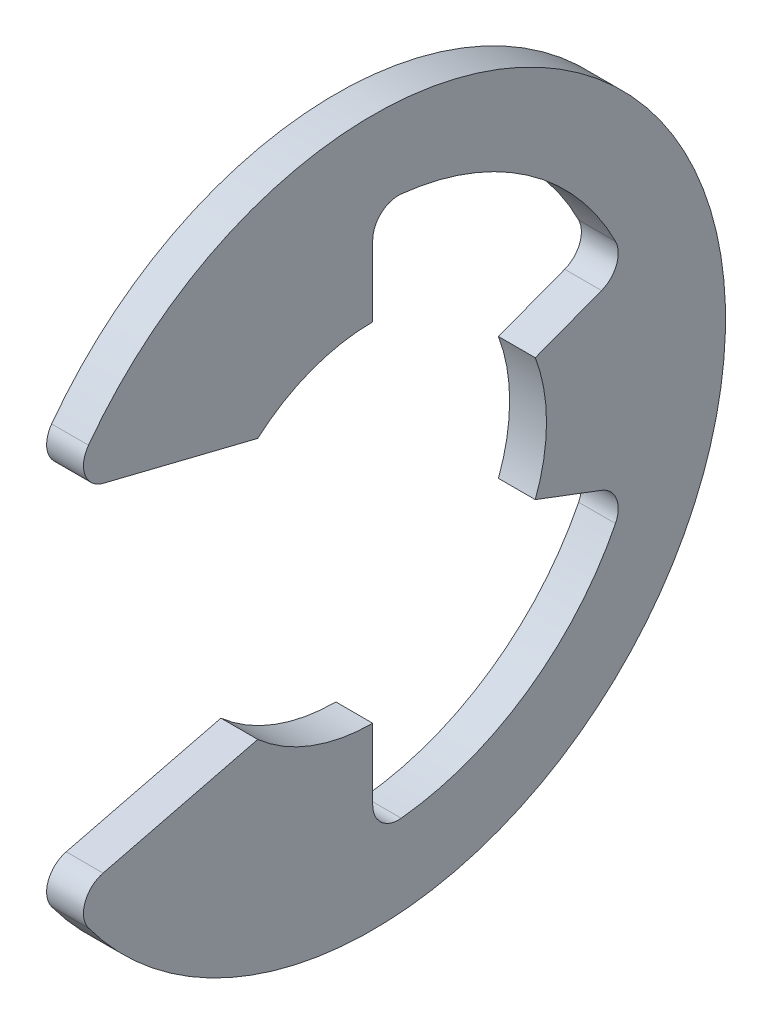
ISO-10303-21;
HEADER;
FILE_DESCRIPTION(('STEP AP214'),'2;1');
FILE_NAME('part.step','',(''),(''),'','','');
FILE_SCHEMA(('AUTOMOTIVE_DESIGN { 1 0 10303 214 1 1 1 1 }'));
ENDSEC;
DATA;
#1=APPLICATION_CONTEXT('core data for automotive mechanical design processes');
#2=APPLICATION_PROTOCOL_DEFINITION('international standard','automotive_design',2000,#1);
#3=PRODUCT_CONTEXT('',#1,'mechanical');
#4=PRODUCT('Part','Part','',(#3));
#5=PRODUCT_RELATED_PRODUCT_CATEGORY('part','',(#4));
#6=PRODUCT_DEFINITION_FORMATION('','',#4);
#7=PRODUCT_DEFINITION_CONTEXT('part definition',#1,'design');
#8=PRODUCT_DEFINITION('design','',#6,#7);
#9=PRODUCT_DEFINITION_SHAPE('','',#8);
#10=(LENGTH_UNIT() NAMED_UNIT(*) SI_UNIT(.MILLI.,.METRE.));
#11=(NAMED_UNIT(*) PLANE_ANGLE_UNIT() SI_UNIT($,.RADIAN.));
#12=(NAMED_UNIT(*) SI_UNIT($,.STERADIAN.) SOLID_ANGLE_UNIT());
#13=UNCERTAINTY_MEASURE_WITH_UNIT(LENGTH_MEASURE(1.E-05),#10,'distance_accuracy_value','');
#14=(GEOMETRIC_REPRESENTATION_CONTEXT(3) GLOBAL_UNCERTAINTY_ASSIGNED_CONTEXT((#13)) GLOBAL_UNIT_ASSIGNED_CONTEXT((#10,
#11,#12)) REPRESENTATION_CONTEXT('',''));
#15=CARTESIAN_POINT('',(0.,0.,0.));
#16=DIRECTION('',(0.,0.,1.));
#17=DIRECTION('',(1.,0.,0.));
#18=AXIS2_PLACEMENT_3D('',#15,#16,#17);
#19=CARTESIAN_POINT('',(-0.5334,0.,0.));
#20=DIRECTION('',(1.,0.,0.));
#21=DIRECTION('',(0.,0.,-1.));
#22=AXIS2_PLACEMENT_3D('',#19,#20,#21);
#23=PLANE('',#22);
#24=CARTESIAN_POINT('',(-0.5334,-5.60812276543936,7.62345146041875));
#25=DIRECTION('',(-1.,0.,0.));
#26=DIRECTION('',(0.,0.,1.));
#27=AXIS2_PLACEMENT_3D('',#24,#25,#26);
#28=CIRCLE('',#27,0.746760000000001);
#29=CARTESIAN_POINT('',(-0.5334,-4.88336468232429,7.80338538873514));
#30=VERTEX_POINT('',#29);
#31=CARTESIAN_POINT('',(-0.5334,-6.05063164709239,8.22497983652265));
#32=VERTEX_POINT('',#31);
#33=EDGE_CURVE('E19',#30,#32,#28,.F.);
#34=ORIENTED_EDGE('',*,*,#33,.F.);
#35=DIRECTION('',(0.,0.240952820606873,-0.970536829925373));
#36=VECTOR('',#35,1.);
#37=CARTESIAN_POINT('',(-0.5334,-5.13688856516319,8.82455735485331));
#38=LINE('',#37,#36);
#39=CARTESIAN_POINT('',(-0.5334,-3.7719,3.32650312340151));
#40=VERTEX_POINT('',#39);
#41=EDGE_CURVE('E143',#30,#40,#38,.T.);
#42=ORIENTED_EDGE('',*,*,#41,.T.);
#43=CARTESIAN_POINT('',(-0.5334,0.,0.));
#44=DIRECTION('',(-1.,0.,0.));
#45=DIRECTION('',(0.,0.,1.));
#46=AXIS2_PLACEMENT_3D('',#43,#44,#45);
#47=CIRCLE('',#46,5.0292);
#48=CARTESIAN_POINT('',(-0.5334,-5.0292,0.));
#49=VERTEX_POINT('',#48);
#50=EDGE_CURVE('E221',#40,#49,#47,.F.);
#51=ORIENTED_EDGE('',*,*,#50,.T.);
#52=DIRECTION('',(0.,-1.,0.));
#53=VECTOR('',#52,1.);
#54=CARTESIAN_POINT('',(-0.5334,-5.0292,0.));
#55=LINE('',#54,#53);
#56=CARTESIAN_POINT('',(-0.5334,-7.07977202193844,0.));
#57=VERTEX_POINT('',#56);
#58=EDGE_CURVE('E164',#49,#57,#55,.T.);
#59=ORIENTED_EDGE('',*,*,#58,.T.);
#60=CARTESIAN_POINT('',(-0.5334,-7.07977202193844,-0.74676));
#61=DIRECTION('',(-1.,0.,0.));
#62=DIRECTION('',(0.,0.,1.));
#63=AXIS2_PLACEMENT_3D('',#60,#61,#62);
#64=CIRCLE('',#63,0.74676);
#65=CARTESIAN_POINT('',(-0.5334,-7.82241228858608,-0.825092189765901));
#66=VERTEX_POINT('',#65);
#67=EDGE_CURVE('E223',#57,#66,#64,.F.);
#68=ORIENTED_EDGE('',*,*,#67,.T.);
#69=CARTESIAN_POINT('',(-0.5334,0.,0.));
#70=DIRECTION('',(-1.,0.,0.));
#71=DIRECTION('',(0.,0.,1.));
#72=AXIS2_PLACEMENT_3D('',#69,#70,#71);
#73=CIRCLE('',#72,7.8658064516129);
#74=CARTESIAN_POINT('',(-0.5334,-3.53744345889986,-7.02548253925108));
#75=VERTEX_POINT('',#74);
#76=EDGE_CURVE('E225',#66,#75,#73,.F.);
#77=ORIENTED_EDGE('',*,*,#76,.T.);
#78=CARTESIAN_POINT('',(-0.5334,-3.20160742052056,-6.35850079068093));
#79=DIRECTION('',(-1.,0.,0.));
#80=DIRECTION('',(0.,0.,1.));
#81=AXIS2_PLACEMENT_3D('',#78,#79,#80);
#82=CIRCLE('',#81,0.74676);
#83=CARTESIAN_POINT('',(-0.5334,-2.50307740298373,-6.62252032064036));
#84=VERTEX_POINT('',#83);
#85=EDGE_CURVE('E171',#75,#84,#82,.F.);
#86=ORIENTED_EDGE('',*,*,#85,.T.);
#87=DIRECTION('',(0.,0.353553390593273,0.935414346693486));
#88=VECTOR('',#87,1.);
#89=CARTESIAN_POINT('',(-0.5334,-1.77809071197169,-4.70438583239088));
#90=LINE('',#89,#88);
#91=CARTESIAN_POINT('',(-0.5334,-1.77809071197169,-4.70438583239088));
#92=VERTEX_POINT('',#91);
#93=EDGE_CURVE('E168',#84,#92,#90,.T.);
#94=ORIENTED_EDGE('',*,*,#93,.T.);
#95=CARTESIAN_POINT('',(-0.5334,0.,0.));
#96=DIRECTION('',(-1.,0.,0.));
#97=DIRECTION('',(0.,0.,1.));
#98=AXIS2_PLACEMENT_3D('',#95,#96,#97);
#99=CIRCLE('',#98,5.0292);
#100=CARTESIAN_POINT('',(-0.5334,1.77809071197169,-4.70438583239087));
#101=VERTEX_POINT('',#100);
#102=EDGE_CURVE('E231',#92,#101,#99,.F.);
#103=ORIENTED_EDGE('',*,*,#102,.T.);
#104=DIRECTION('',(0.,0.353553390593273,-0.935414346693486));
#105=VECTOR('',#104,1.);
#106=CARTESIAN_POINT('',(-0.5334,1.77809071197169,-4.70438583239088));
#107=LINE('',#106,#105);
#108=CARTESIAN_POINT('',(-0.5334,2.50307740298373,-6.62252032064036));
#109=VERTEX_POINT('',#108);
#110=EDGE_CURVE('E173',#101,#109,#107,.T.);
#111=ORIENTED_EDGE('',*,*,#110,.T.);
#112=CARTESIAN_POINT('',(-0.5334,3.20160742052056,-6.35850079068093));
#113=DIRECTION('',(-1.,0.,0.));
#114=DIRECTION('',(0.,0.,1.));
#115=AXIS2_PLACEMENT_3D('',#112,#113,#114);
#116=CIRCLE('',#115,0.74676);
#117=CARTESIAN_POINT('',(-0.5334,3.53744345889986,-7.02548253925108));
#118=VERTEX_POINT('',#117);
#119=EDGE_CURVE('E235',#109,#118,#116,.F.);
#120=ORIENTED_EDGE('',*,*,#119,.T.);
#121=CARTESIAN_POINT('',(-0.5334,0.,0.));
#122=DIRECTION('',(-1.,0.,0.));
#123=DIRECTION('',(0.,0.,1.));
#124=AXIS2_PLACEMENT_3D('',#121,#122,#123);
#125=CIRCLE('',#124,7.8658064516129);
#126=CARTESIAN_POINT('',(-0.5334,7.82241228858608,-0.825092189765899));
#127=VERTEX_POINT('',#126);
#128=EDGE_CURVE('E238',#118,#127,#125,.F.);
#129=ORIENTED_EDGE('',*,*,#128,.T.);
#130=CARTESIAN_POINT('',(-0.5334,7.07977202193844,-0.746759999999999));
#131=DIRECTION('',(-1.,0.,0.));
#132=DIRECTION('',(0.,0.,1.));
#133=AXIS2_PLACEMENT_3D('',#130,#131,#132);
#134=CIRCLE('',#133,0.74676);
#135=CARTESIAN_POINT('',(-0.5334,7.07977202193844,0.));
#136=VERTEX_POINT('',#135);
#137=EDGE_CURVE('E180',#127,#136,#134,.F.);
#138=ORIENTED_EDGE('',*,*,#137,.T.);
#139=DIRECTION('',(0.,-1.,0.));
#140=VECTOR('',#139,1.);
#141=CARTESIAN_POINT('',(-0.5334,5.0292,0.));
#142=LINE('',#141,#140);
#143=CARTESIAN_POINT('',(-0.5334,5.0292,0.));
#144=VERTEX_POINT('',#143);
#145=EDGE_CURVE('E177',#136,#144,#142,.T.);
#146=ORIENTED_EDGE('',*,*,#145,.T.);
#147=CARTESIAN_POINT('',(-0.5334,0.,0.));
#148=DIRECTION('',(-1.,0.,0.));
#149=DIRECTION('',(0.,0.,1.));
#150=AXIS2_PLACEMENT_3D('',#147,#148,#149);
#151=CIRCLE('',#150,5.0292);
#152=CARTESIAN_POINT('',(-0.5334,3.7719,3.32650312340151));
#153=VERTEX_POINT('',#152);
#154=EDGE_CURVE('E242',#144,#153,#151,.F.);
#155=ORIENTED_EDGE('',*,*,#154,.T.);
#156=DIRECTION('',(0.,0.240952820606873,0.970536829925373));
#157=VECTOR('',#156,1.);
#158=CARTESIAN_POINT('',(-0.5334,5.13688856516319,8.82455735485332));
#159=LINE('',#158,#157);
#160=CARTESIAN_POINT('',(-0.5334,4.88336468232429,7.80338538873514));
#161=VERTEX_POINT('',#160);
#162=EDGE_CURVE('E182',#153,#161,#159,.T.);
#163=ORIENTED_EDGE('',*,*,#162,.T.);
#164=CARTESIAN_POINT('',(-0.5334,5.60812276543936,7.62345146041875));
#165=DIRECTION('',(-1.,0.,0.));
#166=DIRECTION('',(0.,0.,1.));
#167=AXIS2_PLACEMENT_3D('',#164,#165,#166);
#168=CIRCLE('',#167,0.74676);
#169=CARTESIAN_POINT('',(-0.5334,6.05063164709238,8.22497983652265));
#170=VERTEX_POINT('',#169);
#171=EDGE_CURVE('E184',#170,#161,#168,.F.);
#172=ORIENTED_EDGE('',*,*,#171,.F.);
#173=CARTESIAN_POINT('',(-0.5334,0.,0.));
#174=DIRECTION('',(-1.,0.,0.));
#175=DIRECTION('',(0.,0.,1.));
#176=AXIS2_PLACEMENT_3D('',#173,#174,#175);
#177=CIRCLE('',#176,10.2108);
#178=EDGE_CURVE('E146',#32,#170,#177,.F.);
#179=ORIENTED_EDGE('',*,*,#178,.F.);
#180=EDGE_LOOP('',(#34,#42,#51,#59,#68,#77,#86,#94,#103,#111,#120,#129,#138,#146,#155,#163,#172,#179));
#181=FACE_BOUND('',#180,.T.);
#182=ADVANCED_FACE('F16',(#181),#23,.F.);
#183=CARTESIAN_POINT('',(0.5334,-5.13688856516319,8.82455735485331));
#184=DIRECTION('',(0.,-0.970536829925373,-0.240952820606873));
#185=DIRECTION('',(0.,0.240952820606873,-0.970536829925373));
#186=AXIS2_PLACEMENT_3D('',#183,#184,#185);
#187=PLANE('',#186);
#188=DIRECTION('',(-1.,0.,0.));
#189=VECTOR('',#188,1.);
#190=CARTESIAN_POINT('',(0.5334,-4.88336468232429,7.80338538873514));
#191=LINE('',#190,#189);
#192=CARTESIAN_POINT('',(0.5334,-4.88336468232429,7.80338538873514));
#193=VERTEX_POINT('',#192);
#194=EDGE_CURVE('E149',#193,#30,#191,.T.);
#195=ORIENTED_EDGE('',*,*,#194,.F.);
#196=DIRECTION('',(0.,-0.240952820606873,0.970536829925373));
#197=VECTOR('',#196,1.);
#198=CARTESIAN_POINT('',(0.5334,-3.7719,3.32650312340151));
#199=LINE('',#198,#197);
#200=CARTESIAN_POINT('',(0.5334,-3.7719,3.32650312340151));
#201=VERTEX_POINT('',#200);
#202=EDGE_CURVE('E220',#201,#193,#199,.T.);
#203=ORIENTED_EDGE('',*,*,#202,.F.);
#204=DIRECTION('',(-1.,0.,0.));
#205=VECTOR('',#204,1.);
#206=CARTESIAN_POINT('',(0.5334,-3.7719,3.32650312340151));
#207=LINE('',#206,#205);
#208=EDGE_CURVE('E154',#201,#40,#207,.T.);
#209=ORIENTED_EDGE('',*,*,#208,.T.);
#210=ORIENTED_EDGE('',*,*,#41,.F.);
#211=EDGE_LOOP('',(#195,#203,#209,#210));
#212=FACE_BOUND('',#211,.T.);
#213=ADVANCED_FACE('F151',(#212),#187,.F.);
#214=CARTESIAN_POINT('',(0.5334,-5.60812276543936,7.62345146041875));
#215=DIRECTION('',(-1.,0.,0.));
#216=DIRECTION('',(0.,0.,1.));
#217=AXIS2_PLACEMENT_3D('',#214,#215,#216);
#218=CYLINDRICAL_SURFACE('',#217,0.746760000000001);
#219=ORIENTED_EDGE('',*,*,#33,.T.);
#220=DIRECTION('',(-1.,0.,0.));
#221=VECTOR('',#220,1.);
#222=CARTESIAN_POINT('',(0.5334,-6.05063164709239,8.22497983652265));
#223=LINE('',#222,#221);
#224=CARTESIAN_POINT('',(0.5334,-6.05063164709239,8.22497983652265));
#225=VERTEX_POINT('',#224);
#226=EDGE_CURVE('E148',#225,#32,#223,.T.);
#227=ORIENTED_EDGE('',*,*,#226,.F.);
#228=CARTESIAN_POINT('',(0.5334,-5.60812276543936,7.62345146041875));
#229=DIRECTION('',(-1.,0.,0.));
#230=DIRECTION('',(0.,0.,1.));
#231=AXIS2_PLACEMENT_3D('',#228,#229,#230);
#232=CIRCLE('',#231,0.746760000000001);
#233=EDGE_CURVE('E158',#193,#225,#232,.F.);
#234=ORIENTED_EDGE('',*,*,#233,.F.);
#235=ORIENTED_EDGE('',*,*,#194,.T.);
#236=EDGE_LOOP('',(#219,#227,#234,#235));
#237=FACE_BOUND('',#236,.T.);
#238=ADVANCED_FACE('F157',(#237),#218,.T.);
#239=CARTESIAN_POINT('',(0.5334,0.,0.));
#240=DIRECTION('',(-1.,0.,0.));
#241=DIRECTION('',(0.,0.,1.));
#242=AXIS2_PLACEMENT_3D('',#239,#240,#241);
#243=CYLINDRICAL_SURFACE('',#242,10.2108);
#244=ORIENTED_EDGE('',*,*,#178,.T.);
#245=DIRECTION('',(-1.,0.,0.));
#246=VECTOR('',#245,1.);
#247=CARTESIAN_POINT('',(0.5334,6.05063164709238,8.22497983652265));
#248=LINE('',#247,#246);
#249=CARTESIAN_POINT('',(0.5334,6.05063164709238,8.22497983652265));
#250=VERTEX_POINT('',#249);
#251=EDGE_CURVE('E247',#250,#170,#248,.T.);
#252=ORIENTED_EDGE('',*,*,#251,.F.);
#253=CARTESIAN_POINT('',(0.5334,0.,0.));
#254=DIRECTION('',(-1.,0.,0.));
#255=DIRECTION('',(0.,0.,1.));
#256=AXIS2_PLACEMENT_3D('',#253,#254,#255);
#257=CIRCLE('',#256,10.2108);
#258=EDGE_CURVE('E216',#225,#250,#257,.F.);
#259=ORIENTED_EDGE('',*,*,#258,.F.);
#260=ORIENTED_EDGE('',*,*,#226,.T.);
#261=EDGE_LOOP('',(#244,#252,#259,#260));
#262=FACE_BOUND('',#261,.T.);
#263=ADVANCED_FACE('F251',(#262),#243,.T.);
#264=CARTESIAN_POINT('',(0.5334,5.60812276543936,7.62345146041875));
#265=DIRECTION('',(-1.,0.,0.));
#266=DIRECTION('',(0.,0.,1.));
#267=AXIS2_PLACEMENT_3D('',#264,#265,#266);
#268=CYLINDRICAL_SURFACE('',#267,0.74676);
#269=ORIENTED_EDGE('',*,*,#171,.T.);
#270=DIRECTION('',(1.,0.,0.));
#271=VECTOR('',#270,1.);
#272=CARTESIAN_POINT('',(0.5334,4.88336468232429,7.80338538873514));
#273=LINE('',#272,#271);
#274=CARTESIAN_POINT('',(0.5334,4.88336468232429,7.80338538873514));
#275=VERTEX_POINT('',#274);
#276=EDGE_CURVE('E183',#161,#275,#273,.T.);
#277=ORIENTED_EDGE('',*,*,#276,.T.);
#278=CARTESIAN_POINT('',(0.5334,5.60812276543936,7.62345146041875));
#279=DIRECTION('',(-1.,0.,0.));
#280=DIRECTION('',(0.,0.,1.));
#281=AXIS2_PLACEMENT_3D('',#278,#279,#280);
#282=CIRCLE('',#281,0.74676);
#283=EDGE_CURVE('E214',#250,#275,#282,.F.);
#284=ORIENTED_EDGE('',*,*,#283,.F.);
#285=ORIENTED_EDGE('',*,*,#251,.T.);
#286=EDGE_LOOP('',(#269,#277,#284,#285));
#287=FACE_BOUND('',#286,.T.);
#288=ADVANCED_FACE('F279',(#287),#268,.T.);
#289=CARTESIAN_POINT('',(0.5334,5.13688856516319,8.82455735485332));
#290=DIRECTION('',(0.,0.970536829925373,-0.240952820606873));
#291=DIRECTION('',(0.,0.240952820606873,0.970536829925373));
#292=AXIS2_PLACEMENT_3D('',#289,#290,#291);
#293=PLANE('',#292);
#294=ORIENTED_EDGE('',*,*,#276,.F.);
#295=ORIENTED_EDGE('',*,*,#162,.F.);
#296=DIRECTION('',(-1.,0.,0.));
#297=VECTOR('',#296,1.);
#298=CARTESIAN_POINT('',(0.5334,3.7719,3.32650312340151));
#299=LINE('',#298,#297);
#300=CARTESIAN_POINT('',(0.5334,3.7719,3.32650312340151));
#301=VERTEX_POINT('',#300);
#302=EDGE_CURVE('E245',#153,#301,#299,.F.);
#303=ORIENTED_EDGE('',*,*,#302,.T.);
#304=DIRECTION('',(0.,-0.240952820606873,-0.970536829925373));
#305=VECTOR('',#304,1.);
#306=CARTESIAN_POINT('',(0.5334,4.88336468232429,7.80338538873514));
#307=LINE('',#306,#305);
#308=EDGE_CURVE('E213',#275,#301,#307,.T.);
#309=ORIENTED_EDGE('',*,*,#308,.F.);
#310=EDGE_LOOP('',(#294,#295,#303,#309));
#311=FACE_BOUND('',#310,.T.);
#312=ADVANCED_FACE('F281',(#311),#293,.F.);
#313=CARTESIAN_POINT('',(0.5334,0.,0.));
#314=DIRECTION('',(-1.,0.,0.));
#315=DIRECTION('',(0.,0.,1.));
#316=AXIS2_PLACEMENT_3D('',#313,#314,#315);
#317=CYLINDRICAL_SURFACE('',#316,5.0292);
#318=DIRECTION('',(1.,0.,0.));
#319=VECTOR('',#318,1.);
#320=CARTESIAN_POINT('',(0.5334,5.0292,0.));
#321=LINE('',#320,#319);
#322=CARTESIAN_POINT('',(0.5334,5.0292,0.));
#323=VERTEX_POINT('',#322);
#324=EDGE_CURVE('E181',#144,#323,#321,.T.);
#325=ORIENTED_EDGE('',*,*,#324,.T.);
#326=CARTESIAN_POINT('',(0.5334,0.,0.));
#327=DIRECTION('',(-1.,0.,0.));
#328=DIRECTION('',(0.,0.,1.));
#329=AXIS2_PLACEMENT_3D('',#326,#327,#328);
#330=CIRCLE('',#329,5.0292);
#331=EDGE_CURVE('E210',#301,#323,#330,.T.);
#332=ORIENTED_EDGE('',*,*,#331,.F.);
#333=ORIENTED_EDGE('',*,*,#302,.F.);
#334=ORIENTED_EDGE('',*,*,#154,.F.);
#335=EDGE_LOOP('',(#325,#332,#333,#334));
#336=FACE_BOUND('',#335,.T.);
#337=ADVANCED_FACE('F287',(#336),#317,.F.);
#338=CARTESIAN_POINT('',(0.5334,5.0292,0.));
#339=DIRECTION('',(0.,0.,1.));
#340=DIRECTION('',(0.,-1.,0.));
#341=AXIS2_PLACEMENT_3D('',#338,#339,#340);
#342=PLANE('',#341);
#343=DIRECTION('',(-1.,0.,0.));
#344=VECTOR('',#343,1.);
#345=CARTESIAN_POINT('',(0.5334,7.07977202193844,0.));
#346=LINE('',#345,#344);
#347=CARTESIAN_POINT('',(0.5334,7.07977202193844,0.));
#348=VERTEX_POINT('',#347);
#349=EDGE_CURVE('E240',#136,#348,#346,.F.);
#350=ORIENTED_EDGE('',*,*,#349,.T.);
#351=DIRECTION('',(0.,1.,0.));
#352=VECTOR('',#351,1.);
#353=CARTESIAN_POINT('',(0.5334,0.,0.));
#354=LINE('',#353,#352);
#355=EDGE_CURVE('E209',#323,#348,#354,.T.);
#356=ORIENTED_EDGE('',*,*,#355,.F.);
#357=ORIENTED_EDGE('',*,*,#324,.F.);
#358=ORIENTED_EDGE('',*,*,#145,.F.);
#359=EDGE_LOOP('',(#350,#356,#357,#358));
#360=FACE_BOUND('',#359,.T.);
#361=ADVANCED_FACE('F291',(#360),#342,.F.);
#362=CARTESIAN_POINT('',(0.5334,7.07977202193844,-0.746759999999999));
#363=DIRECTION('',(-1.,0.,0.));
#364=DIRECTION('',(0.,0.,1.));
#365=AXIS2_PLACEMENT_3D('',#362,#363,#364);
#366=CYLINDRICAL_SURFACE('',#365,0.74676);
#367=ORIENTED_EDGE('',*,*,#349,.F.);
#368=ORIENTED_EDGE('',*,*,#137,.F.);
#369=DIRECTION('',(-1.,0.,0.));
#370=VECTOR('',#369,1.);
#371=CARTESIAN_POINT('',(0.5334,7.82241228858608,-0.8250921897659));
#372=LINE('',#371,#370);
#373=CARTESIAN_POINT('',(0.5334,7.82241228858608,-0.825092189765899));
#374=VERTEX_POINT('',#373);
#375=EDGE_CURVE('E237',#127,#374,#372,.F.);
#376=ORIENTED_EDGE('',*,*,#375,.T.);
#377=CARTESIAN_POINT('',(0.5334,7.07977202193844,-0.746759999999999));
#378=DIRECTION('',(-1.,0.,0.));
#379=DIRECTION('',(0.,0.,1.));
#380=AXIS2_PLACEMENT_3D('',#377,#378,#379);
#381=CIRCLE('',#380,0.74676);
#382=EDGE_CURVE('E206',#348,#374,#381,.T.);
#383=ORIENTED_EDGE('',*,*,#382,.F.);
#384=EDGE_LOOP('',(#367,#368,#376,#383));
#385=FACE_BOUND('',#384,.T.);
#386=ADVANCED_FACE('F340',(#385),#366,.F.);
#387=CARTESIAN_POINT('',(0.5334,0.,0.));
#388=DIRECTION('',(-1.,0.,0.));
#389=DIRECTION('',(0.,0.,1.));
#390=AXIS2_PLACEMENT_3D('',#387,#388,#389);
#391=CYLINDRICAL_SURFACE('',#390,7.8658064516129);
#392=ORIENTED_EDGE('',*,*,#375,.F.);
#393=ORIENTED_EDGE('',*,*,#128,.F.);
#394=DIRECTION('',(-1.,0.,0.));
#395=VECTOR('',#394,1.);
#396=CARTESIAN_POINT('',(0.5334,3.53744345889986,-7.02548253925108));
#397=LINE('',#396,#395);
#398=CARTESIAN_POINT('',(0.5334,3.53744345889986,-7.02548253925108));
#399=VERTEX_POINT('',#398);
#400=EDGE_CURVE('E176',#118,#399,#397,.F.);
#401=ORIENTED_EDGE('',*,*,#400,.T.);
#402=CARTESIAN_POINT('',(0.5334,0.,0.));
#403=DIRECTION('',(-1.,0.,0.));
#404=DIRECTION('',(0.,0.,1.));
#405=AXIS2_PLACEMENT_3D('',#402,#403,#404);
#406=CIRCLE('',#405,7.8658064516129);
#407=EDGE_CURVE('E203',#374,#399,#406,.T.);
#408=ORIENTED_EDGE('',*,*,#407,.F.);
#409=EDGE_LOOP('',(#392,#393,#401,#408));
#410=FACE_BOUND('',#409,.T.);
#411=ADVANCED_FACE('F337',(#410),#391,.F.);
#412=CARTESIAN_POINT('',(0.5334,3.20160742052056,-6.35850079068093));
#413=DIRECTION('',(-1.,0.,0.));
#414=DIRECTION('',(0.,0.,1.));
#415=AXIS2_PLACEMENT_3D('',#412,#413,#414);
#416=CYLINDRICAL_SURFACE('',#415,0.74676);
#417=ORIENTED_EDGE('',*,*,#400,.F.);
#418=ORIENTED_EDGE('',*,*,#119,.F.);
#419=DIRECTION('',(1.,0.,0.));
#420=VECTOR('',#419,1.);
#421=CARTESIAN_POINT('',(0.5334,2.50307740298373,-6.62252032064036));
#422=LINE('',#421,#420);
#423=CARTESIAN_POINT('',(0.5334,2.50307740298373,-6.62252032064036));
#424=VERTEX_POINT('',#423);
#425=EDGE_CURVE('E175',#109,#424,#422,.T.);
#426=ORIENTED_EDGE('',*,*,#425,.T.);
#427=CARTESIAN_POINT('',(0.5334,3.20160742052056,-6.35850079068093));
#428=DIRECTION('',(-1.,0.,0.));
#429=DIRECTION('',(0.,0.,1.));
#430=AXIS2_PLACEMENT_3D('',#427,#428,#429);
#431=CIRCLE('',#430,0.74676);
#432=EDGE_CURVE('E200',#399,#424,#431,.T.);
#433=ORIENTED_EDGE('',*,*,#432,.F.);
#434=EDGE_LOOP('',(#417,#418,#426,#433));
#435=FACE_BOUND('',#434,.T.);
#436=ADVANCED_FACE('F330',(#435),#416,.F.);
#437=CARTESIAN_POINT('',(0.5334,1.77809071197169,-4.70438583239088));
#438=DIRECTION('',(0.,-0.935414346693486,-0.353553390593273));
#439=DIRECTION('',(0.,0.353553390593273,-0.935414346693486));
#440=AXIS2_PLACEMENT_3D('',#437,#438,#439);
#441=PLANE('',#440);
#442=ORIENTED_EDGE('',*,*,#425,.F.);
#443=ORIENTED_EDGE('',*,*,#110,.F.);
#444=DIRECTION('',(-1.,0.,0.));
#445=VECTOR('',#444,1.);
#446=CARTESIAN_POINT('',(0.5334,1.77809071197169,-4.70438583239087));
#447=LINE('',#446,#445);
#448=CARTESIAN_POINT('',(0.5334,1.77809071197169,-4.70438583239087));
#449=VERTEX_POINT('',#448);
#450=EDGE_CURVE('E234',#101,#449,#447,.F.);
#451=ORIENTED_EDGE('',*,*,#450,.T.);
#452=DIRECTION('',(0.,-0.353553390593273,0.935414346693486));
#453=VECTOR('',#452,1.);
#454=CARTESIAN_POINT('',(0.5334,2.50307740298373,-6.62252032064036));
#455=LINE('',#454,#453);
#456=EDGE_CURVE('E199',#424,#449,#455,.T.);
#457=ORIENTED_EDGE('',*,*,#456,.F.);
#458=EDGE_LOOP('',(#442,#443,#451,#457));
#459=FACE_BOUND('',#458,.T.);
#460=ADVANCED_FACE('F333',(#459),#441,.F.);
#461=CARTESIAN_POINT('',(0.5334,0.,0.));
#462=DIRECTION('',(-1.,0.,0.));
#463=DIRECTION('',(0.,0.,1.));
#464=AXIS2_PLACEMENT_3D('',#461,#462,#463);
#465=CYLINDRICAL_SURFACE('',#464,5.0292);
#466=DIRECTION('',(1.,0.,0.));
#467=VECTOR('',#466,1.);
#468=CARTESIAN_POINT('',(0.5334,-1.77809071197169,-4.70438583239088));
#469=LINE('',#468,#467);
#470=CARTESIAN_POINT('',(0.5334,-1.77809071197169,-4.70438583239088));
#471=VERTEX_POINT('',#470);
#472=EDGE_CURVE('E172',#92,#471,#469,.T.);
#473=ORIENTED_EDGE('',*,*,#472,.T.);
#474=CARTESIAN_POINT('',(0.5334,0.,0.));
#475=DIRECTION('',(-1.,0.,0.));
#476=DIRECTION('',(0.,0.,1.));
#477=AXIS2_PLACEMENT_3D('',#474,#475,#476);
#478=CIRCLE('',#477,5.0292);
#479=EDGE_CURVE('E196',#449,#471,#478,.T.);
#480=ORIENTED_EDGE('',*,*,#479,.F.);
#481=ORIENTED_EDGE('',*,*,#450,.F.);
#482=ORIENTED_EDGE('',*,*,#102,.F.);
#483=EDGE_LOOP('',(#473,#480,#481,#482));
#484=FACE_BOUND('',#483,.T.);
#485=ADVANCED_FACE('F322',(#484),#465,.F.);
#486=CARTESIAN_POINT('',(0.5334,-1.77809071197169,-4.70438583239088));
#487=DIRECTION('',(0.,0.935414346693486,-0.353553390593273));
#488=DIRECTION('',(0.,0.353553390593273,0.935414346693486));
#489=AXIS2_PLACEMENT_3D('',#486,#487,#488);
#490=PLANE('',#489);
#491=DIRECTION('',(-1.,0.,0.));
#492=VECTOR('',#491,1.);
#493=CARTESIAN_POINT('',(0.5334,-2.50307740298373,-6.62252032064036));
#494=LINE('',#493,#492);
#495=CARTESIAN_POINT('',(0.5334,-2.50307740298373,-6.62252032064036));
#496=VERTEX_POINT('',#495);
#497=EDGE_CURVE('E230',#84,#496,#494,.F.);
#498=ORIENTED_EDGE('',*,*,#497,.T.);
#499=DIRECTION('',(0.,-0.353553390593273,-0.935414346693486));
#500=VECTOR('',#499,1.);
#501=CARTESIAN_POINT('',(0.5334,-1.77809071197169,-4.70438583239088));
#502=LINE('',#501,#500);
#503=EDGE_CURVE('E195',#471,#496,#502,.T.);
#504=ORIENTED_EDGE('',*,*,#503,.F.);
#505=ORIENTED_EDGE('',*,*,#472,.F.);
#506=ORIENTED_EDGE('',*,*,#93,.F.);
#507=EDGE_LOOP('',(#498,#504,#505,#506));
#508=FACE_BOUND('',#507,.T.);
#509=ADVANCED_FACE('F318',(#508),#490,.F.);
#510=CARTESIAN_POINT('',(0.5334,-3.20160742052056,-6.35850079068093));
#511=DIRECTION('',(-1.,0.,0.));
#512=DIRECTION('',(0.,0.,1.));
#513=AXIS2_PLACEMENT_3D('',#510,#511,#512);
#514=CYLINDRICAL_SURFACE('',#513,0.74676);
#515=ORIENTED_EDGE('',*,*,#497,.F.);
#516=ORIENTED_EDGE('',*,*,#85,.F.);
#517=DIRECTION('',(-1.,0.,0.));
#518=VECTOR('',#517,1.);
#519=CARTESIAN_POINT('',(0.5334,-3.53744345889986,-7.02548253925108));
#520=LINE('',#519,#518);
#521=CARTESIAN_POINT('',(0.5334,-3.53744345889986,-7.02548253925108));
#522=VERTEX_POINT('',#521);
#523=EDGE_CURVE('E228',#75,#522,#520,.F.);
#524=ORIENTED_EDGE('',*,*,#523,.T.);
#525=CARTESIAN_POINT('',(0.5334,-3.20160742052056,-6.35850079068093));
#526=DIRECTION('',(-1.,0.,0.));
#527=DIRECTION('',(0.,0.,1.));
#528=AXIS2_PLACEMENT_3D('',#525,#526,#527);
#529=CIRCLE('',#528,0.74676);
#530=EDGE_CURVE('E192',#496,#522,#529,.T.);
#531=ORIENTED_EDGE('',*,*,#530,.F.);
#532=EDGE_LOOP('',(#515,#516,#524,#531));
#533=FACE_BOUND('',#532,.T.);
#534=ADVANCED_FACE('F314',(#533),#514,.F.);
#535=CARTESIAN_POINT('',(0.5334,0.,0.));
#536=DIRECTION('',(-1.,0.,0.));
#537=DIRECTION('',(0.,0.,1.));
#538=AXIS2_PLACEMENT_3D('',#535,#536,#537);
#539=CYLINDRICAL_SURFACE('',#538,7.8658064516129);
#540=DIRECTION('',(-1.,0.,0.));
#541=VECTOR('',#540,1.);
#542=CARTESIAN_POINT('',(0.5334,-7.82241228858608,-0.825092189765901));
#543=LINE('',#542,#541);
#544=CARTESIAN_POINT('',(0.5334,-7.82241228858608,-0.825092189765901));
#545=VERTEX_POINT('',#544);
#546=EDGE_CURVE('E167',#66,#545,#543,.F.);
#547=ORIENTED_EDGE('',*,*,#546,.T.);
#548=CARTESIAN_POINT('',(0.5334,0.,0.));
#549=DIRECTION('',(-1.,0.,0.));
#550=DIRECTION('',(0.,0.,1.));
#551=AXIS2_PLACEMENT_3D('',#548,#549,#550);
#552=CIRCLE('',#551,7.8658064516129);
#553=EDGE_CURVE('E189',#522,#545,#552,.T.);
#554=ORIENTED_EDGE('',*,*,#553,.F.);
#555=ORIENTED_EDGE('',*,*,#523,.F.);
#556=ORIENTED_EDGE('',*,*,#76,.F.);
#557=EDGE_LOOP('',(#547,#554,#555,#556));
#558=FACE_BOUND('',#557,.T.);
#559=ADVANCED_FACE('F309',(#558),#539,.F.);
#560=CARTESIAN_POINT('',(0.5334,-7.07977202193844,-0.74676));
#561=DIRECTION('',(-1.,0.,0.));
#562=DIRECTION('',(0.,0.,1.));
#563=AXIS2_PLACEMENT_3D('',#560,#561,#562);
#564=CYLINDRICAL_SURFACE('',#563,0.74676);
#565=ORIENTED_EDGE('',*,*,#546,.F.);
#566=ORIENTED_EDGE('',*,*,#67,.F.);
#567=DIRECTION('',(1.,0.,0.));
#568=VECTOR('',#567,1.);
#569=CARTESIAN_POINT('',(0.5334,-7.07977202193844,0.));
#570=LINE('',#569,#568);
#571=CARTESIAN_POINT('',(0.5334,-7.07977202193844,0.));
#572=VERTEX_POINT('',#571);
#573=EDGE_CURVE('E166',#57,#572,#570,.T.);
#574=ORIENTED_EDGE('',*,*,#573,.T.);
#575=CARTESIAN_POINT('',(0.5334,-7.07977202193844,-0.74676));
#576=DIRECTION('',(-1.,0.,0.));
#577=DIRECTION('',(0.,0.,1.));
#578=AXIS2_PLACEMENT_3D('',#575,#576,#577);
#579=CIRCLE('',#578,0.74676);
#580=EDGE_CURVE('E186',#545,#572,#579,.T.);
#581=ORIENTED_EDGE('',*,*,#580,.F.);
#582=EDGE_LOOP('',(#565,#566,#574,#581));
#583=FACE_BOUND('',#582,.T.);
#584=ADVANCED_FACE('F305',(#583),#564,.F.);
#585=CARTESIAN_POINT('',(0.5334,-5.0292,0.));
#586=DIRECTION('',(0.,0.,1.));
#587=DIRECTION('',(0.,-1.,0.));
#588=AXIS2_PLACEMENT_3D('',#585,#586,#587);
#589=PLANE('',#588);
#590=ORIENTED_EDGE('',*,*,#573,.F.);
#591=ORIENTED_EDGE('',*,*,#58,.F.);
#592=DIRECTION('',(-1.,0.,0.));
#593=VECTOR('',#592,1.);
#594=CARTESIAN_POINT('',(0.5334,-5.0292,0.));
#595=LINE('',#594,#593);
#596=CARTESIAN_POINT('',(0.5334,-5.0292,0.));
#597=VERTEX_POINT('',#596);
#598=EDGE_CURVE('E34',#49,#597,#595,.F.);
#599=ORIENTED_EDGE('',*,*,#598,.T.);
#600=DIRECTION('',(0.,1.,0.));
#601=VECTOR('',#600,1.);
#602=CARTESIAN_POINT('',(0.5334,0.,0.));
#603=LINE('',#602,#601);
#604=EDGE_CURVE('E25',#572,#597,#603,.T.);
#605=ORIENTED_EDGE('',*,*,#604,.F.);
#606=EDGE_LOOP('',(#590,#591,#599,#605));
#607=FACE_BOUND('',#606,.T.);
#608=ADVANCED_FACE('F301',(#607),#589,.F.);
#609=CARTESIAN_POINT('',(0.5334,0.,0.));
#610=DIRECTION('',(-1.,0.,0.));
#611=DIRECTION('',(0.,0.,1.));
#612=AXIS2_PLACEMENT_3D('',#609,#610,#611);
#613=CYLINDRICAL_SURFACE('',#612,5.0292);
#614=ORIENTED_EDGE('',*,*,#208,.F.);
#615=CARTESIAN_POINT('',(0.5334,0.,0.));
#616=DIRECTION('',(-1.,0.,0.));
#617=DIRECTION('',(0.,0.,1.));
#618=AXIS2_PLACEMENT_3D('',#615,#616,#617);
#619=CIRCLE('',#618,5.0292);
#620=EDGE_CURVE('E11',#597,#201,#619,.T.);
#621=ORIENTED_EDGE('',*,*,#620,.F.);
#622=ORIENTED_EDGE('',*,*,#598,.F.);
#623=ORIENTED_EDGE('',*,*,#50,.F.);
#624=EDGE_LOOP('',(#614,#621,#622,#623));
#625=FACE_BOUND('',#624,.T.);
#626=ADVANCED_FACE('F351',(#625),#613,.F.);
#627=CARTESIAN_POINT('',(0.5334,0.,0.));
#628=DIRECTION('',(1.,0.,0.));
#629=DIRECTION('',(0.,0.,-1.));
#630=AXIS2_PLACEMENT_3D('',#627,#628,#629);
#631=PLANE('',#630);
#632=ORIENTED_EDGE('',*,*,#604,.T.);
#633=ORIENTED_EDGE('',*,*,#620,.T.);
#634=ORIENTED_EDGE('',*,*,#202,.T.);
#635=ORIENTED_EDGE('',*,*,#233,.T.);
#636=ORIENTED_EDGE('',*,*,#258,.T.);
#637=ORIENTED_EDGE('',*,*,#283,.T.);
#638=ORIENTED_EDGE('',*,*,#308,.T.);
#639=ORIENTED_EDGE('',*,*,#331,.T.);
#640=ORIENTED_EDGE('',*,*,#355,.T.);
#641=ORIENTED_EDGE('',*,*,#382,.T.);
#642=ORIENTED_EDGE('',*,*,#407,.T.);
#643=ORIENTED_EDGE('',*,*,#432,.T.);
#644=ORIENTED_EDGE('',*,*,#456,.T.);
#645=ORIENTED_EDGE('',*,*,#479,.T.);
#646=ORIENTED_EDGE('',*,*,#503,.T.);
#647=ORIENTED_EDGE('',*,*,#530,.T.);
#648=ORIENTED_EDGE('',*,*,#553,.T.);
#649=ORIENTED_EDGE('',*,*,#580,.T.);
#650=EDGE_LOOP('',(#632,#633,#634,#635,#636,#637,#638,#639,#640,#641,#642,#643,#644,#645,#646,
#647,#648,#649));
#651=FACE_BOUND('',#650,.T.);
#652=ADVANCED_FACE('F255',(#651),#631,.T.);
#653=CLOSED_SHELL('',(#182,#213,#238,#263,#288,#312,#337,#361,#386,#411,#436,#460,#485,#509,
#534,#559,#584,#608,#626,#652));
#654=MANIFOLD_SOLID_BREP('B1',#653);
#655=ADVANCED_BREP_SHAPE_REPRESENTATION('',(#18,#654),#14);
#656=SHAPE_DEFINITION_REPRESENTATION(#9,#655);
ENDSEC;
END-ISO-10303-21;
